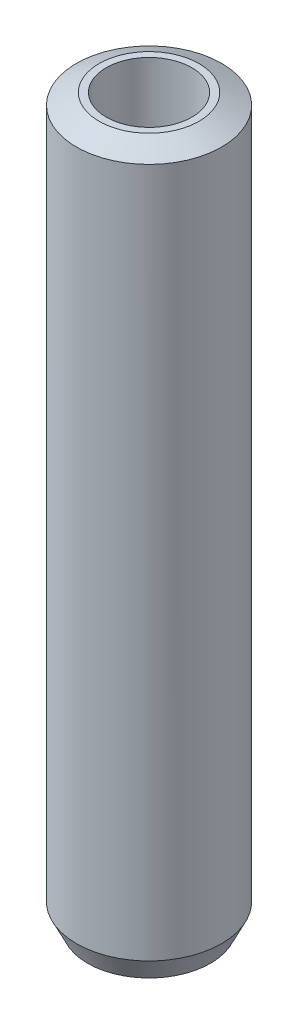
ISO-10303-21;
HEADER;
FILE_DESCRIPTION(('STEP AP214'),'2;1');
FILE_NAME('part.step','',(''),(''),'','','');
FILE_SCHEMA(('AUTOMOTIVE_DESIGN { 1 0 10303 214 1 1 1 1 }'));
ENDSEC;
DATA;
#1=APPLICATION_CONTEXT('core data for automotive mechanical design processes');
#2=APPLICATION_PROTOCOL_DEFINITION('international standard','automotive_design',2000,#1);
#3=PRODUCT_CONTEXT('',#1,'mechanical');
#4=PRODUCT('Part','Part','',(#3));
#5=PRODUCT_RELATED_PRODUCT_CATEGORY('part','',(#4));
#6=PRODUCT_DEFINITION_FORMATION('','',#4);
#7=PRODUCT_DEFINITION_CONTEXT('part definition',#1,'design');
#8=PRODUCT_DEFINITION('design','',#6,#7);
#9=PRODUCT_DEFINITION_SHAPE('','',#8);
#10=(LENGTH_UNIT() NAMED_UNIT(*) SI_UNIT(.MILLI.,.METRE.));
#11=(NAMED_UNIT(*) PLANE_ANGLE_UNIT() SI_UNIT($,.RADIAN.));
#12=(NAMED_UNIT(*) SI_UNIT($,.STERADIAN.) SOLID_ANGLE_UNIT());
#13=UNCERTAINTY_MEASURE_WITH_UNIT(LENGTH_MEASURE(1.E-05),#10,'distance_accuracy_value','');
#14=(GEOMETRIC_REPRESENTATION_CONTEXT(3) GLOBAL_UNCERTAINTY_ASSIGNED_CONTEXT((#13)) GLOBAL_UNIT_ASSIGNED_CONTEXT((#10,
#11,#12)) REPRESENTATION_CONTEXT('',''));
#15=CARTESIAN_POINT('',(0.,0.,0.));
#16=DIRECTION('',(0.,0.,1.));
#17=DIRECTION('',(1.,0.,0.));
#18=AXIS2_PLACEMENT_3D('',#15,#16,#17);
#19=CARTESIAN_POINT('',(0.,224.320014758549,0.));
#20=DIRECTION('',(0.,-1.,0.));
#21=DIRECTION('',(0.,0.,-1.));
#22=AXIS2_PLACEMENT_3D('',#19,#20,#21);
#23=CYLINDRICAL_SURFACE('',#22,22.5);
#24=CARTESIAN_POINT('',(0.,220.89138809885,0.));
#25=DIRECTION('',(0.,1.,0.));
#26=DIRECTION('',(0.,0.,1.));
#27=AXIS2_PLACEMENT_3D('',#24,#25,#26);
#28=CIRCLE('',#27,22.5);
#29=CARTESIAN_POINT('',(0.,220.89138809885,-22.5));
#30=VERTEX_POINT('',#29);
#31=EDGE_CURVE('E50',#30,#30,#28,.F.);
#32=ORIENTED_EDGE('',*,*,#31,.T.);
#33=EDGE_LOOP('',(#32));
#34=FACE_BOUND('',#33,.T.);
#35=CARTESIAN_POINT('',(0.,6.99568793954053,0.));
#36=DIRECTION('',(0.,1.,0.));
#37=DIRECTION('',(0.,0.,1.));
#38=AXIS2_PLACEMENT_3D('',#35,#36,#37);
#39=CIRCLE('',#38,22.5);
#40=CARTESIAN_POINT('',(0.,6.99568793954053,22.5));
#41=VERTEX_POINT('',#40);
#42=EDGE_CURVE('E51',#41,#41,#39,.T.);
#43=ORIENTED_EDGE('',*,*,#42,.T.);
#44=EDGE_LOOP('',(#43));
#45=FACE_BOUND('',#44,.T.);
#46=ADVANCED_FACE('F39',(#34,#45),#23,.T.);
#47=CARTESIAN_POINT('',(0.,224.320014758549,0.));
#48=DIRECTION('',(0.,1.,0.));
#49=DIRECTION('',(0.,0.,1.));
#50=AXIS2_PLACEMENT_3D('',#47,#48,#49);
#51=PLANE('',#50);
#52=CARTESIAN_POINT('',(0.,224.320014758549,0.));
#53=DIRECTION('',(0.,1.,0.));
#54=DIRECTION('',(0.,0.,1.));
#55=AXIS2_PLACEMENT_3D('',#52,#53,#54);
#56=CIRCLE('',#55,15.5043120604596);
#57=CARTESIAN_POINT('',(0.,224.320014758549,-15.5043120604596));
#58=VERTEX_POINT('',#57);
#59=EDGE_CURVE('E54',#58,#58,#56,.T.);
#60=ORIENTED_EDGE('',*,*,#59,.T.);
#61=EDGE_LOOP('',(#60));
#62=FACE_BOUND('',#61,.T.);
#63=CARTESIAN_POINT('',(0.,224.320014758549,0.));
#64=DIRECTION('',(0.,1.,0.));
#65=DIRECTION('',(0.,0.,1.));
#66=AXIS2_PLACEMENT_3D('',#63,#64,#65);
#67=CIRCLE('',#66,13.2879657469701);
#68=CARTESIAN_POINT('',(0.,224.320014758549,13.2879657469701));
#69=VERTEX_POINT('',#68);
#70=EDGE_CURVE('E58',#69,#69,#67,.T.);
#71=ORIENTED_EDGE('',*,*,#70,.F.);
#72=EDGE_LOOP('',(#71));
#73=FACE_BOUND('',#72,.T.);
#74=ADVANCED_FACE('F69',(#62,#73),#51,.T.);
#75=CARTESIAN_POINT('',(0.,0.,0.));
#76=DIRECTION('',(0.,1.,0.));
#77=DIRECTION('',(0.,0.,1.));
#78=AXIS2_PLACEMENT_3D('',#75,#76,#77);
#79=PLANE('',#78);
#80=CARTESIAN_POINT('',(0.,0.,0.));
#81=DIRECTION('',(0.,1.,0.));
#82=DIRECTION('',(0.,0.,1.));
#83=AXIS2_PLACEMENT_3D('',#80,#81,#82);
#84=CIRCLE('',#83,19.0713733403012);
#85=CARTESIAN_POINT('',(0.,0.,19.0713733403012));
#86=VERTEX_POINT('',#85);
#87=EDGE_CURVE('E10',#86,#86,#84,.F.);
#88=ORIENTED_EDGE('',*,*,#87,.T.);
#89=EDGE_LOOP('',(#88));
#90=FACE_BOUND('',#89,.T.);
#91=CARTESIAN_POINT('',(0.,0.,0.));
#92=DIRECTION('',(0.,1.,0.));
#93=DIRECTION('',(0.,0.,1.));
#94=AXIS2_PLACEMENT_3D('',#91,#92,#93);
#95=CIRCLE('',#94,13.2879657469701);
#96=CARTESIAN_POINT('',(0.,0.,13.2879657469701));
#97=VERTEX_POINT('',#96);
#98=EDGE_CURVE('E63',#97,#97,#95,.T.);
#99=ORIENTED_EDGE('',*,*,#98,.T.);
#100=EDGE_LOOP('',(#99));
#101=FACE_BOUND('',#100,.T.);
#102=ADVANCED_FACE('F75',(#90,#101),#79,.F.);
#103=CARTESIAN_POINT('',(0.,224.320014758549,0.));
#104=DIRECTION('',(0.,-1.,0.));
#105=DIRECTION('',(0.,0.,-1.));
#106=AXIS2_PLACEMENT_3D('',#103,#104,#105);
#107=CYLINDRICAL_SURFACE('',#106,13.2879657469701);
#108=ORIENTED_EDGE('',*,*,#70,.T.);
#109=EDGE_LOOP('',(#108));
#110=FACE_BOUND('',#109,.T.);
#111=ORIENTED_EDGE('',*,*,#98,.F.);
#112=EDGE_LOOP('',(#111));
#113=FACE_BOUND('',#112,.T.);
#114=ADVANCED_FACE('F70',(#110,#113),#107,.F.);
#115=CARTESIAN_POINT('',(0.,224.320014758549,0.));
#116=DIRECTION('',(0.,-1.,0.));
#117=DIRECTION('',(0.,0.,-1.));
#118=AXIS2_PLACEMENT_3D('',#115,#116,#117);
#119=CONICAL_SURFACE('',#118,15.5043120604596,1.11509542766193);
#120=CARTESIAN_POINT('',(0.,220.89138809885,-22.5));
#121=CARTESIAN_POINT('',(0.,220.927102959889,-22.4271282506298));
#122=CARTESIAN_POINT('',(0.,220.962817820927,-22.3542565012596));
#123=CARTESIAN_POINT('',(0.,221.034247543005,-22.2085130025192));
#124=CARTESIAN_POINT('',(0.,221.069962404043,-22.135641253149));
#125=CARTESIAN_POINT('',(0.,221.14139212612,-21.9898977544085));
#126=CARTESIAN_POINT('',(0.,221.177106987159,-21.9170260050383));
#127=CARTESIAN_POINT('',(0.,221.248536709236,-21.7712825062979));
#128=CARTESIAN_POINT('',(0.,221.284251570274,-21.6984107569277));
#129=CARTESIAN_POINT('',(0.,221.355681292351,-21.5526672581873));
#130=CARTESIAN_POINT('',(0.,221.39139615339,-21.4797955088171));
#131=CARTESIAN_POINT('',(0.,221.462825875467,-21.3340520100766));
#132=CARTESIAN_POINT('',(0.,221.498540736505,-21.2611802607064));
#133=CARTESIAN_POINT('',(0.,221.569970458582,-21.115436761966));
#134=CARTESIAN_POINT('',(0.,221.605685319621,-21.0425650125958));
#135=CARTESIAN_POINT('',(0.,221.677115041698,-20.8968215138553));
#136=CARTESIAN_POINT('',(0.,221.712829902737,-20.8239497644851));
#137=CARTESIAN_POINT('',(0.,221.784259624814,-20.6782062657447));
#138=CARTESIAN_POINT('',(0.,221.819974485852,-20.6053345163745));
#139=CARTESIAN_POINT('',(0.,221.891404207929,-20.4595910176341));
#140=CARTESIAN_POINT('',(0.,221.927119068968,-20.3867192682639));
#141=CARTESIAN_POINT('',(0.,221.998548791045,-20.2409757695234));
#142=CARTESIAN_POINT('',(0.,222.034263652083,-20.1681040201532));
#143=CARTESIAN_POINT('',(0.,222.10569337416,-20.0223605214128));
#144=CARTESIAN_POINT('',(0.,222.141408235199,-19.9494887720426));
#145=CARTESIAN_POINT('',(0.,222.212837957276,-19.8037452733022));
#146=CARTESIAN_POINT('',(0.,222.248552818315,-19.7308735239319));
#147=CARTESIAN_POINT('',(0.,222.319982540392,-19.5851300251915));
#148=CARTESIAN_POINT('',(0.,222.35569740143,-19.5122582758213));
#149=CARTESIAN_POINT('',(0.,222.427127123507,-19.3665147770809));
#150=CARTESIAN_POINT('',(0.,222.462841984546,-19.2936430277107));
#151=CARTESIAN_POINT('',(0.,222.534271706623,-19.1478995289702));
#152=CARTESIAN_POINT('',(0.,222.569986567661,-19.0750277796));
#153=CARTESIAN_POINT('',(0.,222.641416289738,-18.9292842808596));
#154=CARTESIAN_POINT('',(0.,222.677131150777,-18.8564125314894));
#155=CARTESIAN_POINT('',(0.,222.748560872854,-18.710669032749));
#156=CARTESIAN_POINT('',(0.,222.784275733892,-18.6377972833788));
#157=CARTESIAN_POINT('',(0.,222.85570545597,-18.4920537846383));
#158=CARTESIAN_POINT('',(0.,222.891420317008,-18.4191820352681));
#159=CARTESIAN_POINT('',(0.,222.962850039085,-18.2734385365277));
#160=CARTESIAN_POINT('',(0.,222.998564900124,-18.2005667871575));
#161=CARTESIAN_POINT('',(0.,223.069994622201,-18.054823288417));
#162=CARTESIAN_POINT('',(0.,223.105709483239,-17.9819515390468));
#163=CARTESIAN_POINT('',(0.,223.177139205316,-17.8362080403064));
#164=CARTESIAN_POINT('',(0.,223.212854066355,-17.7633362909362));
#165=CARTESIAN_POINT('',(0.,223.284283788432,-17.6175927921958));
#166=CARTESIAN_POINT('',(0.,223.31999864947,-17.5447210428256));
#167=CARTESIAN_POINT('',(0.,223.391428371547,-17.3989775440851));
#168=CARTESIAN_POINT('',(0.,223.427143232586,-17.3261057947149));
#169=CARTESIAN_POINT('',(0.,223.498572954663,-17.1803622959745));
#170=CARTESIAN_POINT('',(0.,223.534287815702,-17.1074905466043));
#171=CARTESIAN_POINT('',(0.,223.605717537779,-16.9617470478639));
#172=CARTESIAN_POINT('',(0.,223.641432398817,-16.8888752984936));
#173=CARTESIAN_POINT('',(0.,223.712862120894,-16.7431317997532));
#174=CARTESIAN_POINT('',(0.,223.748576981933,-16.670260050383));
#175=CARTESIAN_POINT('',(0.,223.82000670401,-16.5245165516426));
#176=CARTESIAN_POINT('',(0.,223.855721565048,-16.4516448022724));
#177=CARTESIAN_POINT('',(0.,223.927151287125,-16.3059013035319));
#178=CARTESIAN_POINT('',(0.,223.962866148164,-16.2330295541617));
#179=CARTESIAN_POINT('',(0.,224.034295870241,-16.0872860554213));
#180=CARTESIAN_POINT('',(0.,224.070010731279,-16.0144143060511));
#181=CARTESIAN_POINT('',(0.,224.141440453357,-15.8686708073107));
#182=CARTESIAN_POINT('',(0.,224.177155314395,-15.7957990579404));
#183=CARTESIAN_POINT('',(0.,224.248585036472,-15.6500555592));
#184=CARTESIAN_POINT('',(0.,224.284299897511,-15.5771838098298));
#185=CARTESIAN_POINT('',(0.,224.320014758549,-15.5043120604596));
#186=B_SPLINE_CURVE_WITH_KNOTS('',3,(#120,#121,#122,#123,#124,#125,#126,#127,#128,#129,#130,
#131,#132,#133,#134,#135,#136,#137,#138,#139,#140,#141,#142,#143,#144,#145,#146,#147,#148,#149,
#150,#151,#152,#153,#154,#155,#156,#157,#158,#159,#160,#161,#162,#163,#164,#165,#166,#167,#168,
#169,#170,#171,#172,#173,#174,#175,#176,#177,#178,#179,#180,#181,#182,#183,#184,#185),
.UNSPECIFIED.,.F.,.F.,(4,2,2,2,2,2,2,2,2,2,2,2,2,2,2,2,2,2,2,2,2,2,2,2,2,2,2,2,2,2,2,2,4),(0.,
0.243459623752048,0.486919247504096,0.730378871256144,0.973838495008195,1.21729811876024,
1.46075774251229,1.70421736626434,1.94767699001639,2.19113661376844,2.43459623752048,
2.67805586127253,2.92151548502458,3.16497510877663,3.40843473252867,3.65189435628072,
3.89535398003277,4.13881360378482,4.38227322753687,4.62573285128892,4.86919247504097,
5.11265209879301,5.35611172254506,5.59957134629711,5.84303097004916,6.08649059380121,
6.32995021755325,6.5734098413053,6.81686946505735,7.0603290888094,7.30378871256145,
7.5472483363135,7.79070796006556),.UNSPECIFIED.);
#187=EDGE_CURVE('BSEAM81',#30,#58,#186,.T.);
#188=ORIENTED_EDGE('',*,*,#31,.F.);
#189=ORIENTED_EDGE('',*,*,#59,.F.);
#190=ORIENTED_EDGE('',*,*,#187,.T.);
#191=ORIENTED_EDGE('',*,*,#187,.F.);
#192=EDGE_LOOP('',(#188,#190,#189,#191));
#193=FACE_BOUND('',#192,.T.);
#194=ADVANCED_FACE('F81',(#193),#119,.T.);
#195=CARTESIAN_POINT('',(0.,6.99568793954053,0.));
#196=DIRECTION('',(0.,1.,0.));
#197=DIRECTION('',(0.,0.,1.));
#198=AXIS2_PLACEMENT_3D('',#195,#196,#197);
#199=CONICAL_SURFACE('',#198,22.5,0.455700899132968);
#200=ORIENTED_EDGE('',*,*,#87,.F.);
#201=EDGE_LOOP('',(#200));
#202=FACE_BOUND('',#201,.T.);
#203=ORIENTED_EDGE('',*,*,#42,.F.);
#204=EDGE_LOOP('',(#203));
#205=FACE_BOUND('',#204,.T.);
#206=ADVANCED_FACE('F45',(#202,#205),#199,.T.);
#207=CLOSED_SHELL('',(#46,#74,#102,#114,#194,#206));
#208=MANIFOLD_SOLID_BREP('B2',#207);
#209=ADVANCED_BREP_SHAPE_REPRESENTATION('',(#18,#208),#14);
#210=SHAPE_DEFINITION_REPRESENTATION(#9,#209);
ENDSEC;
END-ISO-10303-21;
